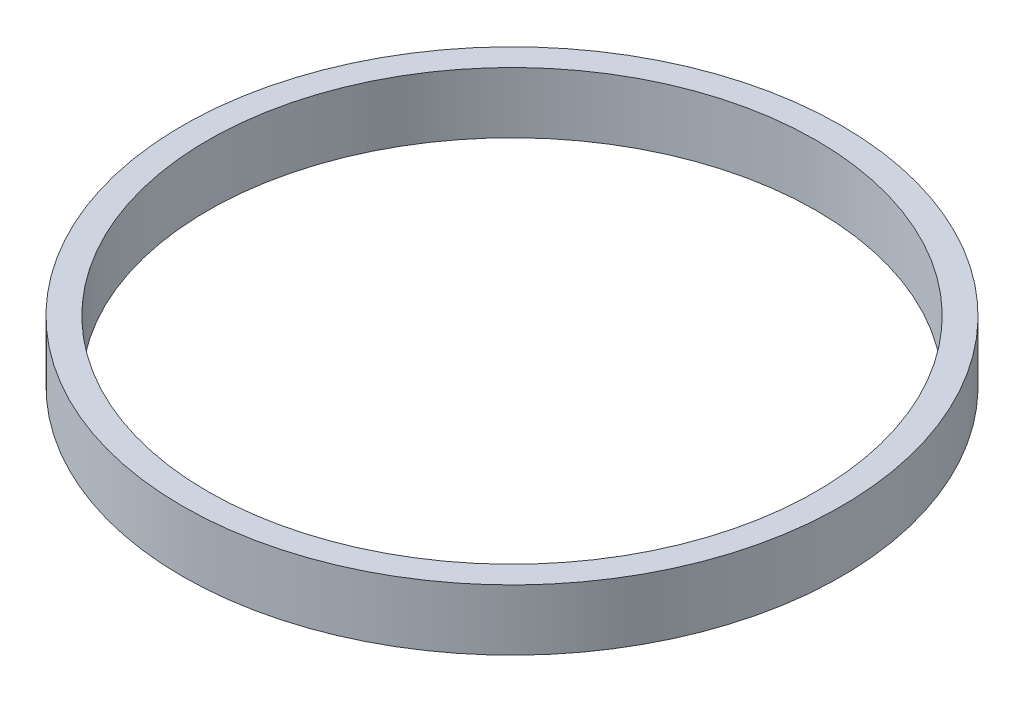
ISO-10303-21;
HEADER;
FILE_DESCRIPTION(('STEP AP214'),'2;1');
FILE_NAME('part.step','',(''),(''),'','','');
FILE_SCHEMA(('AUTOMOTIVE_DESIGN { 1 0 10303 214 1 1 1 1 }'));
ENDSEC;
DATA;
#1=APPLICATION_CONTEXT('core data for automotive mechanical design processes');
#2=APPLICATION_PROTOCOL_DEFINITION('international standard','automotive_design',2000,#1);
#3=PRODUCT_CONTEXT('',#1,'mechanical');
#4=PRODUCT('Part','Part','',(#3));
#5=PRODUCT_RELATED_PRODUCT_CATEGORY('part','',(#4));
#6=PRODUCT_DEFINITION_FORMATION('','',#4);
#7=PRODUCT_DEFINITION_CONTEXT('part definition',#1,'design');
#8=PRODUCT_DEFINITION('design','',#6,#7);
#9=PRODUCT_DEFINITION_SHAPE('','',#8);
#10=(LENGTH_UNIT() NAMED_UNIT(*) SI_UNIT(.MILLI.,.METRE.));
#11=(NAMED_UNIT(*) PLANE_ANGLE_UNIT() SI_UNIT($,.RADIAN.));
#12=(NAMED_UNIT(*) SI_UNIT($,.STERADIAN.) SOLID_ANGLE_UNIT());
#13=UNCERTAINTY_MEASURE_WITH_UNIT(LENGTH_MEASURE(1.E-05),#10,'distance_accuracy_value','');
#14=(GEOMETRIC_REPRESENTATION_CONTEXT(3) GLOBAL_UNCERTAINTY_ASSIGNED_CONTEXT((#13)) GLOBAL_UNIT_ASSIGNED_CONTEXT((#10,
#11,#12)) REPRESENTATION_CONTEXT('',''));
#15=CARTESIAN_POINT('',(0.,0.,0.));
#16=DIRECTION('',(0.,0.,1.));
#17=DIRECTION('',(1.,0.,0.));
#18=AXIS2_PLACEMENT_3D('',#15,#16,#17);
#19=CARTESIAN_POINT('',(0.,6.,0.));
#20=DIRECTION('',(0.,1.,0.));
#21=DIRECTION('',(0.,0.,1.));
#22=AXIS2_PLACEMENT_3D('',#19,#20,#21);
#23=PLANE('',#22);
#24=CARTESIAN_POINT('',(0.,6.,0.));
#25=DIRECTION('',(0.,1.,0.));
#26=DIRECTION('',(0.,0.,1.));
#27=AXIS2_PLACEMENT_3D('',#24,#25,#26);
#28=CIRCLE('',#27,32.5);
#29=CARTESIAN_POINT('',(0.,6.,32.5));
#30=VERTEX_POINT('',#29);
#31=EDGE_CURVE('E10',#30,#30,#28,.T.);
#32=ORIENTED_EDGE('',*,*,#31,.T.);
#33=EDGE_LOOP('',(#32));
#34=FACE_BOUND('',#33,.T.);
#35=CARTESIAN_POINT('',(0.,6.,0.));
#36=DIRECTION('',(0.,1.,0.));
#37=DIRECTION('',(0.,0.,1.));
#38=AXIS2_PLACEMENT_3D('',#35,#36,#37);
#39=CIRCLE('',#38,30.);
#40=CARTESIAN_POINT('',(0.,6.,30.));
#41=VERTEX_POINT('',#40);
#42=EDGE_CURVE('E41',#41,#41,#39,.T.);
#43=ORIENTED_EDGE('',*,*,#42,.F.);
#44=EDGE_LOOP('',(#43));
#45=FACE_BOUND('',#44,.T.);
#46=ADVANCED_FACE('F30',(#34,#45),#23,.T.);
#47=CARTESIAN_POINT('',(0.,0.,0.));
#48=DIRECTION('',(0.,1.,0.));
#49=DIRECTION('',(0.,0.,1.));
#50=AXIS2_PLACEMENT_3D('',#47,#48,#49);
#51=PLANE('',#50);
#52=CARTESIAN_POINT('',(0.,0.,0.));
#53=DIRECTION('',(0.,1.,0.));
#54=DIRECTION('',(0.,0.,1.));
#55=AXIS2_PLACEMENT_3D('',#52,#53,#54);
#56=CIRCLE('',#55,32.5);
#57=CARTESIAN_POINT('',(0.,0.,32.5));
#58=VERTEX_POINT('',#57);
#59=EDGE_CURVE('E34',#58,#58,#56,.T.);
#60=ORIENTED_EDGE('',*,*,#59,.F.);
#61=EDGE_LOOP('',(#60));
#62=FACE_BOUND('',#61,.T.);
#63=CARTESIAN_POINT('',(0.,0.,0.));
#64=DIRECTION('',(0.,1.,0.));
#65=DIRECTION('',(0.,0.,1.));
#66=AXIS2_PLACEMENT_3D('',#63,#64,#65);
#67=CIRCLE('',#66,30.);
#68=CARTESIAN_POINT('',(0.,0.,30.));
#69=VERTEX_POINT('',#68);
#70=EDGE_CURVE('E43',#69,#69,#67,.T.);
#71=ORIENTED_EDGE('',*,*,#70,.T.);
#72=EDGE_LOOP('',(#71));
#73=FACE_BOUND('',#72,.T.);
#74=ADVANCED_FACE('F53',(#62,#73),#51,.F.);
#75=CARTESIAN_POINT('',(0.,6.,0.));
#76=DIRECTION('',(0.,-1.,0.));
#77=DIRECTION('',(0.,0.,-1.));
#78=AXIS2_PLACEMENT_3D('',#75,#76,#77);
#79=CYLINDRICAL_SURFACE('',#78,32.5);
#80=ORIENTED_EDGE('',*,*,#31,.F.);
#81=EDGE_LOOP('',(#80));
#82=FACE_BOUND('',#81,.T.);
#83=ORIENTED_EDGE('',*,*,#59,.T.);
#84=EDGE_LOOP('',(#83));
#85=FACE_BOUND('',#84,.T.);
#86=ADVANCED_FACE('F32',(#82,#85),#79,.T.);
#87=CARTESIAN_POINT('',(0.,6.,0.));
#88=DIRECTION('',(0.,-1.,0.));
#89=DIRECTION('',(0.,0.,-1.));
#90=AXIS2_PLACEMENT_3D('',#87,#88,#89);
#91=CYLINDRICAL_SURFACE('',#90,30.);
#92=ORIENTED_EDGE('',*,*,#42,.T.);
#93=EDGE_LOOP('',(#92));
#94=FACE_BOUND('',#93,.T.);
#95=ORIENTED_EDGE('',*,*,#70,.F.);
#96=EDGE_LOOP('',(#95));
#97=FACE_BOUND('',#96,.T.);
#98=ADVANCED_FACE('F49',(#94,#97),#91,.F.);
#99=CLOSED_SHELL('',(#46,#74,#86,#98));
#100=MANIFOLD_SOLID_BREP('B2',#99);
#101=ADVANCED_BREP_SHAPE_REPRESENTATION('',(#18,#100),#14);
#102=SHAPE_DEFINITION_REPRESENTATION(#9,#101);
ENDSEC;
END-ISO-10303-21;
